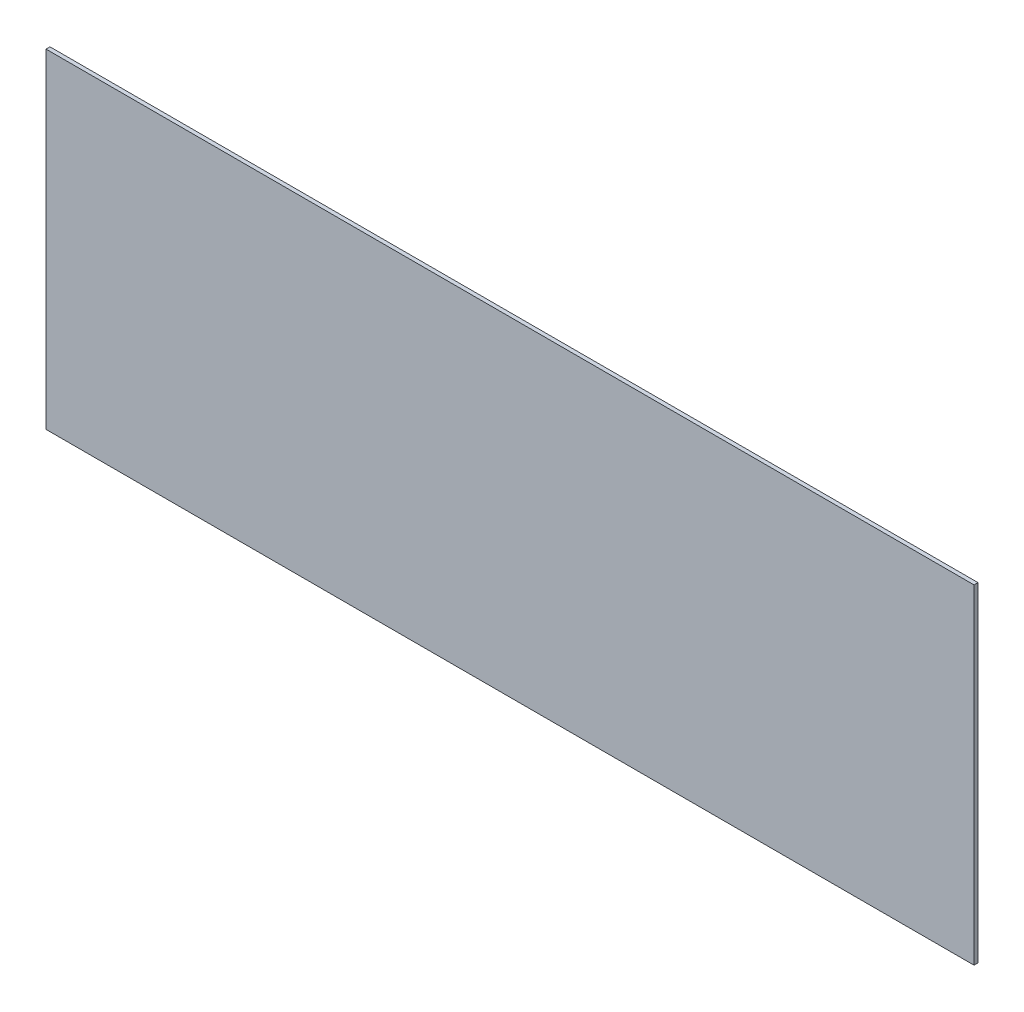
ISO-10303-21;
HEADER;
FILE_DESCRIPTION(('STEP AP214'),'2;1');
FILE_NAME('part.step','',(''),(''),'','','');
FILE_SCHEMA(('AUTOMOTIVE_DESIGN { 1 0 10303 214 1 1 1 1 }'));
ENDSEC;
DATA;
#1=APPLICATION_CONTEXT('core data for automotive mechanical design processes');
#2=APPLICATION_PROTOCOL_DEFINITION('international standard','automotive_design',2000,#1);
#3=PRODUCT_CONTEXT('',#1,'mechanical');
#4=PRODUCT('Part','Part','',(#3));
#5=PRODUCT_RELATED_PRODUCT_CATEGORY('part','',(#4));
#6=PRODUCT_DEFINITION_FORMATION('','',#4);
#7=PRODUCT_DEFINITION_CONTEXT('part definition',#1,'design');
#8=PRODUCT_DEFINITION('design','',#6,#7);
#9=PRODUCT_DEFINITION_SHAPE('','',#8);
#10=(LENGTH_UNIT() NAMED_UNIT(*) SI_UNIT(.MILLI.,.METRE.));
#11=(NAMED_UNIT(*) PLANE_ANGLE_UNIT() SI_UNIT($,.RADIAN.));
#12=(NAMED_UNIT(*) SI_UNIT($,.STERADIAN.) SOLID_ANGLE_UNIT());
#13=UNCERTAINTY_MEASURE_WITH_UNIT(LENGTH_MEASURE(1.E-05),#10,'distance_accuracy_value','');
#14=(GEOMETRIC_REPRESENTATION_CONTEXT(3) GLOBAL_UNCERTAINTY_ASSIGNED_CONTEXT((#13)) GLOBAL_UNIT_ASSIGNED_CONTEXT((#10,
#11,#12)) REPRESENTATION_CONTEXT('',''));
#15=CARTESIAN_POINT('',(0.,0.,0.));
#16=DIRECTION('',(0.,0.,1.));
#17=DIRECTION('',(1.,0.,0.));
#18=AXIS2_PLACEMENT_3D('',#15,#16,#17);
#19=CARTESIAN_POINT('',(372.5,132.2,3.175));
#20=DIRECTION('',(-1.,0.,0.));
#21=DIRECTION('',(0.,-1.,0.));
#22=AXIS2_PLACEMENT_3D('',#19,#20,#21);
#23=PLANE('',#22);
#24=DIRECTION('',(0.,1.,0.));
#25=VECTOR('',#24,1.);
#26=CARTESIAN_POINT('',(372.5,132.2,0.));
#27=LINE('',#26,#25);
#28=CARTESIAN_POINT('',(372.5,-132.2,0.));
#29=VERTEX_POINT('',#28);
#30=CARTESIAN_POINT('',(372.5,132.2,0.));
#31=VERTEX_POINT('',#30);
#32=EDGE_CURVE('E114',#29,#31,#27,.T.);
#33=ORIENTED_EDGE('',*,*,#32,.T.);
#34=DIRECTION('',(0.,0.,-1.));
#35=VECTOR('',#34,1.);
#36=CARTESIAN_POINT('',(372.5,132.2,3.175));
#37=LINE('',#36,#35);
#38=CARTESIAN_POINT('',(372.5,132.2,3.175));
#39=VERTEX_POINT('',#38);
#40=EDGE_CURVE('E11',#39,#31,#37,.T.);
#41=ORIENTED_EDGE('',*,*,#40,.F.);
#42=DIRECTION('',(0.,1.,0.));
#43=VECTOR('',#42,1.);
#44=CARTESIAN_POINT('',(372.5,132.2,3.175));
#45=LINE('',#44,#43);
#46=CARTESIAN_POINT('',(372.5,-132.2,3.175));
#47=VERTEX_POINT('',#46);
#48=EDGE_CURVE('E98',#47,#39,#45,.T.);
#49=ORIENTED_EDGE('',*,*,#48,.F.);
#50=DIRECTION('',(0.,0.,-1.));
#51=VECTOR('',#50,1.);
#52=CARTESIAN_POINT('',(372.5,-132.2,3.175));
#53=LINE('',#52,#51);
#54=EDGE_CURVE('E110',#47,#29,#53,.T.);
#55=ORIENTED_EDGE('',*,*,#54,.T.);
#56=EDGE_LOOP('',(#33,#41,#49,#55));
#57=FACE_BOUND('',#56,.T.);
#58=ADVANCED_FACE('F45',(#57),#23,.F.);
#59=CARTESIAN_POINT('',(-372.5,132.2,3.175));
#60=DIRECTION('',(0.,-1.,0.));
#61=DIRECTION('',(0.,0.,-1.));
#62=AXIS2_PLACEMENT_3D('',#59,#60,#61);
#63=PLANE('',#62);
#64=DIRECTION('',(-1.,0.,0.));
#65=VECTOR('',#64,1.);
#66=CARTESIAN_POINT('',(-372.5,132.2,0.));
#67=LINE('',#66,#65);
#68=CARTESIAN_POINT('',(-372.5,132.2,0.));
#69=VERTEX_POINT('',#68);
#70=EDGE_CURVE('E102',#31,#69,#67,.T.);
#71=ORIENTED_EDGE('',*,*,#70,.T.);
#72=DIRECTION('',(0.,0.,-1.));
#73=VECTOR('',#72,1.);
#74=CARTESIAN_POINT('',(-372.5,132.2,3.175));
#75=LINE('',#74,#73);
#76=CARTESIAN_POINT('',(-372.5,132.2,3.175));
#77=VERTEX_POINT('',#76);
#78=EDGE_CURVE('E53',#77,#69,#75,.T.);
#79=ORIENTED_EDGE('',*,*,#78,.F.);
#80=DIRECTION('',(-1.,0.,0.));
#81=VECTOR('',#80,1.);
#82=CARTESIAN_POINT('',(-372.5,132.2,3.175));
#83=LINE('',#82,#81);
#84=EDGE_CURVE('E93',#39,#77,#83,.T.);
#85=ORIENTED_EDGE('',*,*,#84,.F.);
#86=ORIENTED_EDGE('',*,*,#40,.T.);
#87=EDGE_LOOP('',(#71,#79,#85,#86));
#88=FACE_BOUND('',#87,.T.);
#89=ADVANCED_FACE('F101',(#88),#63,.F.);
#90=CARTESIAN_POINT('',(-372.5,132.2,3.175));
#91=DIRECTION('',(1.,0.,0.));
#92=DIRECTION('',(0.,1.,0.));
#93=AXIS2_PLACEMENT_3D('',#90,#91,#92);
#94=PLANE('',#93);
#95=DIRECTION('',(0.,-1.,0.));
#96=VECTOR('',#95,1.);
#97=CARTESIAN_POINT('',(-372.5,132.2,0.));
#98=LINE('',#97,#96);
#99=CARTESIAN_POINT('',(-372.5,-132.2,0.));
#100=VERTEX_POINT('',#99);
#101=EDGE_CURVE('E80',#69,#100,#98,.T.);
#102=ORIENTED_EDGE('',*,*,#101,.T.);
#103=DIRECTION('',(0.,0.,-1.));
#104=VECTOR('',#103,1.);
#105=CARTESIAN_POINT('',(-372.5,-132.2,3.175));
#106=LINE('',#105,#104);
#107=CARTESIAN_POINT('',(-372.5,-132.2,3.175));
#108=VERTEX_POINT('',#107);
#109=EDGE_CURVE('E103',#108,#100,#106,.T.);
#110=ORIENTED_EDGE('',*,*,#109,.F.);
#111=DIRECTION('',(0.,-1.,0.));
#112=VECTOR('',#111,1.);
#113=CARTESIAN_POINT('',(-372.5,132.2,3.175));
#114=LINE('',#113,#112);
#115=EDGE_CURVE('E96',#77,#108,#114,.T.);
#116=ORIENTED_EDGE('',*,*,#115,.F.);
#117=ORIENTED_EDGE('',*,*,#78,.T.);
#118=EDGE_LOOP('',(#102,#110,#116,#117));
#119=FACE_BOUND('',#118,.T.);
#120=ADVANCED_FACE('F104',(#119),#94,.F.);
#121=CARTESIAN_POINT('',(-372.5,-132.2,3.175));
#122=DIRECTION('',(0.,1.,0.));
#123=DIRECTION('',(0.,0.,1.));
#124=AXIS2_PLACEMENT_3D('',#121,#122,#123);
#125=PLANE('',#124);
#126=DIRECTION('',(1.,0.,0.));
#127=VECTOR('',#126,1.);
#128=CARTESIAN_POINT('',(-372.5,-132.2,0.));
#129=LINE('',#128,#127);
#130=EDGE_CURVE('E86',#100,#29,#129,.T.);
#131=ORIENTED_EDGE('',*,*,#130,.T.);
#132=ORIENTED_EDGE('',*,*,#54,.F.);
#133=DIRECTION('',(1.,0.,0.));
#134=VECTOR('',#133,1.);
#135=CARTESIAN_POINT('',(-372.5,-132.2,3.175));
#136=LINE('',#135,#134);
#137=EDGE_CURVE('E61',#108,#47,#136,.T.);
#138=ORIENTED_EDGE('',*,*,#137,.F.);
#139=ORIENTED_EDGE('',*,*,#109,.T.);
#140=EDGE_LOOP('',(#131,#132,#138,#139));
#141=FACE_BOUND('',#140,.T.);
#142=ADVANCED_FACE('F122',(#141),#125,.F.);
#143=CARTESIAN_POINT('',(0.,0.,3.175));
#144=DIRECTION('',(0.,0.,1.));
#145=DIRECTION('',(1.,0.,0.));
#146=AXIS2_PLACEMENT_3D('',#143,#144,#145);
#147=PLANE('',#146);
#148=ORIENTED_EDGE('',*,*,#48,.T.);
#149=ORIENTED_EDGE('',*,*,#84,.T.);
#150=ORIENTED_EDGE('',*,*,#115,.T.);
#151=ORIENTED_EDGE('',*,*,#137,.T.);
#152=EDGE_LOOP('',(#148,#149,#150,#151));
#153=FACE_BOUND('',#152,.T.);
#154=ADVANCED_FACE('F94',(#153),#147,.T.);
#155=CARTESIAN_POINT('',(0.,0.,0.));
#156=DIRECTION('',(0.,0.,1.));
#157=DIRECTION('',(1.,0.,0.));
#158=AXIS2_PLACEMENT_3D('',#155,#156,#157);
#159=PLANE('',#158);
#160=ORIENTED_EDGE('',*,*,#32,.F.);
#161=ORIENTED_EDGE('',*,*,#130,.F.);
#162=ORIENTED_EDGE('',*,*,#101,.F.);
#163=ORIENTED_EDGE('',*,*,#70,.F.);
#164=EDGE_LOOP('',(#160,#161,#162,#163));
#165=FACE_BOUND('',#164,.T.);
#166=ADVANCED_FACE('F125',(#165),#159,.F.);
#167=CLOSED_SHELL('',(#58,#89,#120,#142,#154,#166));
#168=MANIFOLD_SOLID_BREP('B2',#167);
#169=ADVANCED_BREP_SHAPE_REPRESENTATION('',(#18,#168),#14);
#170=SHAPE_DEFINITION_REPRESENTATION(#9,#169);
ENDSEC;
END-ISO-10303-21;
